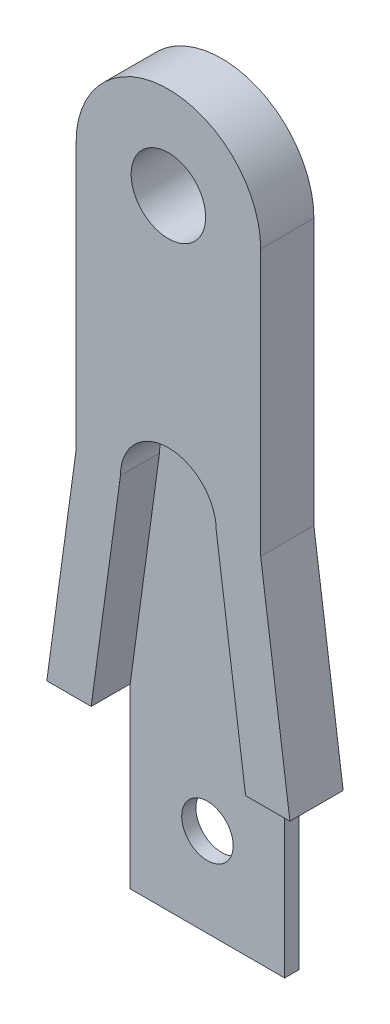
ISO-10303-21;
HEADER;
FILE_DESCRIPTION(('STEP AP214'),'2;1');
FILE_NAME('part.step','',(''),(''),'','','');
FILE_SCHEMA(('AUTOMOTIVE_DESIGN { 1 0 10303 214 1 1 1 1 }'));
ENDSEC;
DATA;
#1=APPLICATION_CONTEXT('core data for automotive mechanical design processes');
#2=APPLICATION_PROTOCOL_DEFINITION('international standard','automotive_design',2000,#1);
#3=PRODUCT_CONTEXT('',#1,'mechanical');
#4=PRODUCT('Part','Part','',(#3));
#5=PRODUCT_RELATED_PRODUCT_CATEGORY('part','',(#4));
#6=PRODUCT_DEFINITION_FORMATION('','',#4);
#7=PRODUCT_DEFINITION_CONTEXT('part definition',#1,'design');
#8=PRODUCT_DEFINITION('design','',#6,#7);
#9=PRODUCT_DEFINITION_SHAPE('','',#8);
#10=(LENGTH_UNIT() NAMED_UNIT(*) SI_UNIT(.MILLI.,.METRE.));
#11=(NAMED_UNIT(*) PLANE_ANGLE_UNIT() SI_UNIT($,.RADIAN.));
#12=(NAMED_UNIT(*) SI_UNIT($,.STERADIAN.) SOLID_ANGLE_UNIT());
#13=UNCERTAINTY_MEASURE_WITH_UNIT(LENGTH_MEASURE(1.E-05),#10,'distance_accuracy_value','');
#14=(GEOMETRIC_REPRESENTATION_CONTEXT(3) GLOBAL_UNCERTAINTY_ASSIGNED_CONTEXT((#13)) GLOBAL_UNIT_ASSIGNED_CONTEXT((#10,
#11,#12)) REPRESENTATION_CONTEXT('',''));
#15=CARTESIAN_POINT('',(0.,0.,0.));
#16=DIRECTION('',(0.,0.,1.));
#17=DIRECTION('',(1.,0.,0.));
#18=AXIS2_PLACEMENT_3D('',#15,#16,#17);
#19=CARTESIAN_POINT('',(3.59168404829559,4.41177816907904,7.05608106349905));
#20=DIRECTION('',(0.,-1.,0.));
#21=DIRECTION('',(1.,0.,0.));
#22=AXIS2_PLACEMENT_3D('',#19,#20,#21);
#23=PLANE('',#22);
#24=DIRECTION('',(0.,0.,1.));
#25=VECTOR('',#24,1.);
#26=CARTESIAN_POINT('',(1.09168404829559,4.41177816907904,4.85608106349905));
#27=LINE('',#26,#25);
#28=CARTESIAN_POINT('',(1.09168404829559,4.41177816907904,4.05608106349905));
#29=VERTEX_POINT('',#28);
#30=CARTESIAN_POINT('',(1.09168404829559,4.41177816907904,4.85608106349905));
#31=VERTEX_POINT('',#30);
#32=EDGE_CURVE('E63',#29,#31,#27,.T.);
#33=ORIENTED_EDGE('',*,*,#32,.F.);
#34=DIRECTION('',(-1.,0.,0.));
#35=VECTOR('',#34,1.);
#36=CARTESIAN_POINT('',(3.59168404829559,4.41177816907904,4.05608106349905));
#37=LINE('',#36,#35);
#38=CARTESIAN_POINT('',(3.59168404829559,4.41177816907904,4.05608106349905));
#39=VERTEX_POINT('',#38);
#40=EDGE_CURVE('E244',#39,#29,#37,.T.);
#41=ORIENTED_EDGE('',*,*,#40,.F.);
#42=DIRECTION('',(0.,0.,-1.));
#43=VECTOR('',#42,1.);
#44=CARTESIAN_POINT('',(3.59168404829559,4.41177816907904,7.05608106349905));
#45=LINE('',#44,#43);
#46=CARTESIAN_POINT('',(3.59168404829559,4.41177816907904,7.05608106349905));
#47=VERTEX_POINT('',#46);
#48=EDGE_CURVE('E266',#47,#39,#45,.T.);
#49=ORIENTED_EDGE('',*,*,#48,.F.);
#50=DIRECTION('',(-1.,0.,0.));
#51=VECTOR('',#50,1.);
#52=CARTESIAN_POINT('',(3.59168404829559,4.41177816907904,7.05608106349905));
#53=LINE('',#52,#51);
#54=CARTESIAN_POINT('',(1.09168404829559,4.41177816907904,7.05608106349905));
#55=VERTEX_POINT('',#54);
#56=EDGE_CURVE('E220',#47,#55,#53,.T.);
#57=ORIENTED_EDGE('',*,*,#56,.T.);
#58=DIRECTION('',(0.,0.,1.));
#59=VECTOR('',#58,1.);
#60=CARTESIAN_POINT('',(1.09168404829559,4.41177816907904,4.85608106349905));
#61=LINE('',#60,#59);
#62=EDGE_CURVE('E70',#31,#55,#61,.T.);
#63=ORIENTED_EDGE('',*,*,#62,.F.);
#64=EDGE_LOOP('',(#33,#41,#49,#57,#63));
#65=FACE_BOUND('',#64,.T.);
#66=ADVANCED_FACE('F45',(#65),#23,.T.);
#67=CARTESIAN_POINT('',(1.94168404829558,31.511778169079,7.05608106349905));
#68=DIRECTION('',(1.,0.,0.));
#69=DIRECTION('',(0.,1.,0.));
#70=AXIS2_PLACEMENT_3D('',#67,#68,#69);
#71=PLANE('',#70);
#72=DIRECTION('',(0.,-1.,0.));
#73=VECTOR('',#72,1.);
#74=CARTESIAN_POINT('',(1.94168404829558,31.511778169079,4.05608106349905));
#75=LINE('',#74,#73);
#76=CARTESIAN_POINT('',(1.94168404829558,31.511778169079,4.05608106349905));
#77=VERTEX_POINT('',#76);
#78=CARTESIAN_POINT('',(1.94168404829559,16.511778169079,4.05608106349905));
#79=VERTEX_POINT('',#78);
#80=EDGE_CURVE('E201',#77,#79,#75,.T.);
#81=ORIENTED_EDGE('',*,*,#80,.F.);
#82=DIRECTION('',(0.,0.,-1.));
#83=VECTOR('',#82,1.);
#84=CARTESIAN_POINT('',(1.94168404829558,31.511778169079,7.05608106349905));
#85=LINE('',#84,#83);
#86=CARTESIAN_POINT('',(1.94168404829558,31.511778169079,7.05608106349905));
#87=VERTEX_POINT('',#86);
#88=EDGE_CURVE('E11',#87,#77,#85,.T.);
#89=ORIENTED_EDGE('',*,*,#88,.F.);
#90=DIRECTION('',(0.,-1.,0.));
#91=VECTOR('',#90,1.);
#92=CARTESIAN_POINT('',(1.94168404829558,31.511778169079,7.05608106349905));
#93=LINE('',#92,#91);
#94=CARTESIAN_POINT('',(1.94168404829559,16.511778169079,7.05608106349905));
#95=VERTEX_POINT('',#94);
#96=EDGE_CURVE('E210',#87,#95,#93,.T.);
#97=ORIENTED_EDGE('',*,*,#96,.T.);
#98=DIRECTION('',(0.,0.,-1.));
#99=VECTOR('',#98,1.);
#100=CARTESIAN_POINT('',(1.94168404829559,16.511778169079,7.05608106349905));
#101=LINE('',#100,#99);
#102=EDGE_CURVE('E49',#95,#79,#101,.T.);
#103=ORIENTED_EDGE('',*,*,#102,.T.);
#104=EDGE_LOOP('',(#81,#89,#97,#103));
#105=FACE_BOUND('',#104,.T.);
#106=ADVANCED_FACE('F47',(#105),#71,.T.);
#107=CARTESIAN_POINT('',(-3.25831595170442,31.511778169079,7.05608106349905));
#108=DIRECTION('',(0.,0.,-1.));
#109=DIRECTION('',(-1.,0.,0.));
#110=AXIS2_PLACEMENT_3D('',#107,#108,#109);
#111=CYLINDRICAL_SURFACE('',#110,5.2);
#112=CARTESIAN_POINT('',(-3.25831595170442,31.511778169079,4.05608106349905));
#113=DIRECTION('',(0.,0.,-1.));
#114=DIRECTION('',(-1.,0.,0.));
#115=AXIS2_PLACEMENT_3D('',#112,#113,#114);
#116=CIRCLE('',#115,5.2);
#117=CARTESIAN_POINT('',(-8.45831595170442,31.511778169079,4.05608106349905));
#118=VERTEX_POINT('',#117);
#119=EDGE_CURVE('E215',#118,#77,#116,.T.);
#120=ORIENTED_EDGE('',*,*,#119,.F.);
#121=DIRECTION('',(0.,0.,-1.));
#122=VECTOR('',#121,1.);
#123=CARTESIAN_POINT('',(-8.45831595170442,31.511778169079,7.05608106349905));
#124=LINE('',#123,#122);
#125=CARTESIAN_POINT('',(-8.45831595170442,31.511778169079,7.05608106349905));
#126=VERTEX_POINT('',#125);
#127=EDGE_CURVE('E55',#126,#118,#124,.T.);
#128=ORIENTED_EDGE('',*,*,#127,.F.);
#129=CARTESIAN_POINT('',(-3.25831595170442,31.511778169079,7.05608106349905));
#130=DIRECTION('',(0.,0.,-1.));
#131=DIRECTION('',(-1.,0.,0.));
#132=AXIS2_PLACEMENT_3D('',#129,#130,#131);
#133=CIRCLE('',#132,5.2);
#134=EDGE_CURVE('E232',#126,#87,#133,.T.);
#135=ORIENTED_EDGE('',*,*,#134,.T.);
#136=ORIENTED_EDGE('',*,*,#88,.T.);
#137=EDGE_LOOP('',(#120,#128,#135,#136));
#138=FACE_BOUND('',#137,.T.);
#139=ADVANCED_FACE('F281',(#138),#111,.T.);
#140=CARTESIAN_POINT('',(-8.45831595170441,16.511778169079,7.05608106349905));
#141=DIRECTION('',(-1.,0.,0.));
#142=DIRECTION('',(0.,-1.,0.));
#143=AXIS2_PLACEMENT_3D('',#140,#141,#142);
#144=PLANE('',#143);
#145=DIRECTION('',(0.,1.,0.));
#146=VECTOR('',#145,1.);
#147=CARTESIAN_POINT('',(-8.45831595170441,16.511778169079,4.05608106349905));
#148=LINE('',#147,#146);
#149=CARTESIAN_POINT('',(-8.45831595170441,16.511778169079,4.05608106349905));
#150=VERTEX_POINT('',#149);
#151=EDGE_CURVE('E251',#150,#118,#148,.T.);
#152=ORIENTED_EDGE('',*,*,#151,.F.);
#153=DIRECTION('',(0.,0.,-1.));
#154=VECTOR('',#153,1.);
#155=CARTESIAN_POINT('',(-8.45831595170441,16.511778169079,7.05608106349905));
#156=LINE('',#155,#154);
#157=CARTESIAN_POINT('',(-8.45831595170441,16.511778169079,7.05608106349905));
#158=VERTEX_POINT('',#157);
#159=EDGE_CURVE('E260',#158,#150,#156,.T.);
#160=ORIENTED_EDGE('',*,*,#159,.F.);
#161=DIRECTION('',(0.,1.,0.));
#162=VECTOR('',#161,1.);
#163=CARTESIAN_POINT('',(-8.45831595170441,16.511778169079,7.05608106349905));
#164=LINE('',#163,#162);
#165=EDGE_CURVE('E228',#158,#126,#164,.T.);
#166=ORIENTED_EDGE('',*,*,#165,.T.);
#167=ORIENTED_EDGE('',*,*,#127,.T.);
#168=EDGE_LOOP('',(#152,#160,#166,#167));
#169=FACE_BOUND('',#168,.T.);
#170=ADVANCED_FACE('F359',(#169),#144,.T.);
#171=CARTESIAN_POINT('',(-10.1083159517044,4.41177816907904,7.05608106349905));
#172=DIRECTION('',(-0.990830168044299,0.135113204733313,0.));
#173=DIRECTION('',(-0.135113204733313,-0.990830168044299,0.));
#174=AXIS2_PLACEMENT_3D('',#171,#172,#173);
#175=PLANE('',#174);
#176=DIRECTION('',(0.135113204733313,0.990830168044299,0.));
#177=VECTOR('',#176,1.);
#178=CARTESIAN_POINT('',(-10.1083159517044,4.41177816907904,4.05608106349905));
#179=LINE('',#178,#177);
#180=CARTESIAN_POINT('',(-10.1083159517044,4.41177816907904,4.05608106349905));
#181=VERTEX_POINT('',#180);
#182=EDGE_CURVE('E247',#181,#150,#179,.T.);
#183=ORIENTED_EDGE('',*,*,#182,.F.);
#184=DIRECTION('',(0.,0.,-1.));
#185=VECTOR('',#184,1.);
#186=CARTESIAN_POINT('',(-10.1083159517044,4.41177816907904,7.05608106349905));
#187=LINE('',#186,#185);
#188=CARTESIAN_POINT('',(-10.1083159517044,4.41177816907904,7.05608106349905));
#189=VERTEX_POINT('',#188);
#190=EDGE_CURVE('E263',#189,#181,#187,.T.);
#191=ORIENTED_EDGE('',*,*,#190,.F.);
#192=DIRECTION('',(0.135113204733313,0.990830168044299,0.));
#193=VECTOR('',#192,1.);
#194=CARTESIAN_POINT('',(-10.1083159517044,4.41177816907904,7.05608106349905));
#195=LINE('',#194,#193);
#196=EDGE_CURVE('E224',#189,#158,#195,.T.);
#197=ORIENTED_EDGE('',*,*,#196,.T.);
#198=ORIENTED_EDGE('',*,*,#159,.T.);
#199=EDGE_LOOP('',(#183,#191,#197,#198));
#200=FACE_BOUND('',#199,.T.);
#201=ADVANCED_FACE('F352',(#200),#175,.T.);
#202=DIRECTION('',(0.,0.,-1.));
#203=VECTOR('',#202,1.);
#204=CARTESIAN_POINT('',(-7.60831595170441,4.41177816907904,4.05608106349905));
#205=LINE('',#204,#203);
#206=CARTESIAN_POINT('',(-7.60831595170441,4.41177816907903,4.85608106349905));
#207=VERTEX_POINT('',#206);
#208=CARTESIAN_POINT('',(-7.60831595170441,4.41177816907904,4.05608106349905));
#209=VERTEX_POINT('',#208);
#210=EDGE_CURVE('E167',#207,#209,#205,.T.);
#211=ORIENTED_EDGE('',*,*,#210,.F.);
#212=DIRECTION('',(0.,0.,1.));
#213=VECTOR('',#212,1.);
#214=CARTESIAN_POINT('',(-7.60831595170441,4.41177816907903,4.85608106349905));
#215=LINE('',#214,#213);
#216=CARTESIAN_POINT('',(-7.60831595170441,4.41177816907903,7.05608106349905));
#217=VERTEX_POINT('',#216);
#218=EDGE_CURVE('E197',#207,#217,#215,.T.);
#219=ORIENTED_EDGE('',*,*,#218,.T.);
#220=EDGE_CURVE('E219',#217,#189,#53,.T.);
#221=ORIENTED_EDGE('',*,*,#220,.T.);
#222=ORIENTED_EDGE('',*,*,#190,.T.);
#223=EDGE_CURVE('E243',#209,#181,#37,.T.);
#224=ORIENTED_EDGE('',*,*,#223,.F.);
#225=EDGE_LOOP('',(#211,#219,#221,#222,#224));
#226=FACE_BOUND('',#225,.T.);
#227=ADVANCED_FACE('F345',(#226),#23,.T.);
#228=CARTESIAN_POINT('',(1.94168404829559,16.511778169079,7.05608106349905));
#229=DIRECTION('',(0.990830168044299,0.135113204733314,0.));
#230=DIRECTION('',(-0.135113204733314,0.990830168044299,0.));
#231=AXIS2_PLACEMENT_3D('',#228,#229,#230);
#232=PLANE('',#231);
#233=DIRECTION('',(0.135113204733314,-0.990830168044299,0.));
#234=VECTOR('',#233,1.);
#235=CARTESIAN_POINT('',(1.94168404829559,16.511778169079,4.05608106349905));
#236=LINE('',#235,#234);
#237=EDGE_CURVE('E239',#79,#39,#236,.T.);
#238=ORIENTED_EDGE('',*,*,#237,.F.);
#239=ORIENTED_EDGE('',*,*,#102,.F.);
#240=DIRECTION('',(0.135113204733314,-0.990830168044299,0.));
#241=VECTOR('',#240,1.);
#242=CARTESIAN_POINT('',(1.94168404829559,16.511778169079,7.05608106349905));
#243=LINE('',#242,#241);
#244=EDGE_CURVE('E214',#95,#47,#243,.T.);
#245=ORIENTED_EDGE('',*,*,#244,.T.);
#246=ORIENTED_EDGE('',*,*,#48,.T.);
#247=EDGE_LOOP('',(#238,#239,#245,#246));
#248=FACE_BOUND('',#247,.T.);
#249=ADVANCED_FACE('F275',(#248),#232,.T.);
#250=CARTESIAN_POINT('',(-3.25831595170442,31.511778169079,7.05608106349905));
#251=DIRECTION('',(0.,0.,-1.));
#252=DIRECTION('',(-1.,0.,0.));
#253=AXIS2_PLACEMENT_3D('',#250,#251,#252);
#254=PLANE('',#253);
#255=CARTESIAN_POINT('',(-3.25831595170442,31.511778169079,7.05608106349905));
#256=DIRECTION('',(0.,0.,-1.));
#257=DIRECTION('',(-1.,0.,0.));
#258=AXIS2_PLACEMENT_3D('',#255,#256,#257);
#259=CIRCLE('',#258,2.1);
#260=CARTESIAN_POINT('',(-5.35831595170442,31.511778169079,7.05608106349905));
#261=VERTEX_POINT('',#260);
#262=EDGE_CURVE('E301',#261,#261,#259,.T.);
#263=ORIENTED_EDGE('',*,*,#262,.T.);
#264=EDGE_LOOP('',(#263));
#265=FACE_BOUND('',#264,.T.);
#266=ORIENTED_EDGE('',*,*,#220,.F.);
#267=DIRECTION('',(-0.135113204733313,-0.990830168044299,0.));
#268=VECTOR('',#267,1.);
#269=CARTESIAN_POINT('',(-5.95831595170441,16.511778169079,7.05608106349905));
#270=LINE('',#269,#268);
#271=CARTESIAN_POINT('',(-5.95831595170441,16.511778169079,7.05608106349905));
#272=VERTEX_POINT('',#271);
#273=EDGE_CURVE('E185',#272,#217,#270,.T.);
#274=ORIENTED_EDGE('',*,*,#273,.F.);
#275=CARTESIAN_POINT('',(-3.25831595170441,16.511778169079,7.05608106349905));
#276=DIRECTION('',(0.,0.,1.));
#277=DIRECTION('',(1.,0.,0.));
#278=AXIS2_PLACEMENT_3D('',#275,#276,#277);
#279=CIRCLE('',#278,2.7);
#280=CARTESIAN_POINT('',(-0.558315951704415,16.511778169079,7.05608106349905));
#281=VERTEX_POINT('',#280);
#282=EDGE_CURVE('E175',#281,#272,#279,.T.);
#283=ORIENTED_EDGE('',*,*,#282,.F.);
#284=DIRECTION('',(-0.135113204733314,0.990830168044299,0.));
#285=VECTOR('',#284,1.);
#286=CARTESIAN_POINT('',(1.09168404829559,4.41177816907904,7.05608106349905));
#287=LINE('',#286,#285);
#288=EDGE_CURVE('E171',#55,#281,#287,.T.);
#289=ORIENTED_EDGE('',*,*,#288,.F.);
#290=ORIENTED_EDGE('',*,*,#56,.F.);
#291=ORIENTED_EDGE('',*,*,#244,.F.);
#292=ORIENTED_EDGE('',*,*,#96,.F.);
#293=ORIENTED_EDGE('',*,*,#134,.F.);
#294=ORIENTED_EDGE('',*,*,#165,.F.);
#295=ORIENTED_EDGE('',*,*,#196,.F.);
#296=EDGE_LOOP('',(#266,#274,#283,#289,#290,#291,#292,#293,#294,#295));
#297=FACE_BOUND('',#296,.T.);
#298=ADVANCED_FACE('F285',(#265,#297),#254,.F.);
#299=CARTESIAN_POINT('',(-3.25831595170442,31.511778169079,4.05608106349905));
#300=DIRECTION('',(0.,0.,-1.));
#301=DIRECTION('',(-1.,0.,0.));
#302=AXIS2_PLACEMENT_3D('',#299,#300,#301);
#303=PLANE('',#302);
#304=CARTESIAN_POINT('',(-3.25831595170441,-0.588221830920964,4.05608106349905));
#305=DIRECTION('',(0.,0.,-1.));
#306=DIRECTION('',(-1.,0.,0.));
#307=AXIS2_PLACEMENT_3D('',#304,#305,#306);
#308=CIRCLE('',#307,1.44999999999999);
#309=CARTESIAN_POINT('',(-4.7083159517044,-0.588221830920964,4.05608106349905));
#310=VERTEX_POINT('',#309);
#311=EDGE_CURVE('E316',#310,#310,#308,.T.);
#312=ORIENTED_EDGE('',*,*,#311,.F.);
#313=EDGE_LOOP('',(#312));
#314=FACE_BOUND('',#313,.T.);
#315=CARTESIAN_POINT('',(-3.25831595170442,31.511778169079,4.05608106349905));
#316=DIRECTION('',(0.,0.,-1.));
#317=DIRECTION('',(-1.,0.,0.));
#318=AXIS2_PLACEMENT_3D('',#315,#316,#317);
#319=CIRCLE('',#318,2.1);
#320=CARTESIAN_POINT('',(-5.35831595170442,31.511778169079,4.05608106349905));
#321=VERTEX_POINT('',#320);
#322=EDGE_CURVE('E308',#321,#321,#319,.T.);
#323=ORIENTED_EDGE('',*,*,#322,.F.);
#324=EDGE_LOOP('',(#323));
#325=FACE_BOUND('',#324,.T.);
#326=ORIENTED_EDGE('',*,*,#80,.T.);
#327=ORIENTED_EDGE('',*,*,#237,.T.);
#328=ORIENTED_EDGE('',*,*,#40,.T.);
#329=DIRECTION('',(0.,1.,0.));
#330=VECTOR('',#329,1.);
#331=CARTESIAN_POINT('',(1.09168404829559,-5.58822183092096,4.05608106349905));
#332=LINE('',#331,#330);
#333=CARTESIAN_POINT('',(1.09168404829559,-5.58822183092096,4.05608106349905));
#334=VERTEX_POINT('',#333);
#335=EDGE_CURVE('E289',#334,#29,#332,.T.);
#336=ORIENTED_EDGE('',*,*,#335,.F.);
#337=DIRECTION('',(1.,0.,0.));
#338=VECTOR('',#337,1.);
#339=CARTESIAN_POINT('',(1.09168404829559,-5.58822183092096,4.05608106349905));
#340=LINE('',#339,#338);
#341=CARTESIAN_POINT('',(-7.60831595170441,-5.58822183092096,4.05608106349905));
#342=VERTEX_POINT('',#341);
#343=EDGE_CURVE('E162',#342,#334,#340,.T.);
#344=ORIENTED_EDGE('',*,*,#343,.F.);
#345=DIRECTION('',(0.,1.,0.));
#346=VECTOR('',#345,1.);
#347=CARTESIAN_POINT('',(-7.60831595170441,-5.58822183092096,4.05608106349905));
#348=LINE('',#347,#346);
#349=EDGE_CURVE('E177',#342,#209,#348,.T.);
#350=ORIENTED_EDGE('',*,*,#349,.T.);
#351=ORIENTED_EDGE('',*,*,#223,.T.);
#352=ORIENTED_EDGE('',*,*,#182,.T.);
#353=ORIENTED_EDGE('',*,*,#151,.T.);
#354=ORIENTED_EDGE('',*,*,#119,.T.);
#355=EDGE_LOOP('',(#326,#327,#328,#336,#344,#350,#351,#352,#353,#354));
#356=FACE_BOUND('',#355,.T.);
#357=ADVANCED_FACE('F277',(#314,#325,#356),#303,.T.);
#358=CARTESIAN_POINT('',(-5.95831595170441,16.511778169079,4.85608106349905));
#359=DIRECTION('',(-0.990830168044299,0.135113204733313,0.));
#360=DIRECTION('',(-0.135113204733313,-0.990830168044299,0.));
#361=AXIS2_PLACEMENT_3D('',#358,#359,#360);
#362=PLANE('',#361);
#363=ORIENTED_EDGE('',*,*,#273,.T.);
#364=ORIENTED_EDGE('',*,*,#218,.F.);
#365=DIRECTION('',(-0.135113204733313,-0.990830168044299,0.));
#366=VECTOR('',#365,1.);
#367=CARTESIAN_POINT('',(-5.95831595170441,16.511778169079,4.85608106349905));
#368=LINE('',#367,#366);
#369=CARTESIAN_POINT('',(-5.95831595170441,16.511778169079,4.85608106349905));
#370=VERTEX_POINT('',#369);
#371=EDGE_CURVE('E189',#370,#207,#368,.T.);
#372=ORIENTED_EDGE('',*,*,#371,.F.);
#373=DIRECTION('',(0.,0.,1.));
#374=VECTOR('',#373,1.);
#375=CARTESIAN_POINT('',(-5.95831595170441,16.511778169079,4.85608106349905));
#376=LINE('',#375,#374);
#377=EDGE_CURVE('E202',#370,#272,#376,.T.);
#378=ORIENTED_EDGE('',*,*,#377,.T.);
#379=EDGE_LOOP('',(#363,#364,#372,#378));
#380=FACE_BOUND('',#379,.T.);
#381=ADVANCED_FACE('F325',(#380),#362,.F.);
#382=CARTESIAN_POINT('',(-3.25831595170441,16.511778169079,4.85608106349905));
#383=DIRECTION('',(0.,0.,1.));
#384=DIRECTION('',(1.,0.,0.));
#385=AXIS2_PLACEMENT_3D('',#382,#383,#384);
#386=CYLINDRICAL_SURFACE('',#385,2.7);
#387=ORIENTED_EDGE('',*,*,#282,.T.);
#388=ORIENTED_EDGE('',*,*,#377,.F.);
#389=CARTESIAN_POINT('',(-3.25831595170441,16.511778169079,4.85608106349905));
#390=DIRECTION('',(0.,0.,1.));
#391=DIRECTION('',(1.,0.,0.));
#392=AXIS2_PLACEMENT_3D('',#389,#390,#391);
#393=CIRCLE('',#392,2.7);
#394=CARTESIAN_POINT('',(-0.558315951704415,16.511778169079,4.85608106349905));
#395=VERTEX_POINT('',#394);
#396=EDGE_CURVE('E184',#395,#370,#393,.T.);
#397=ORIENTED_EDGE('',*,*,#396,.F.);
#398=DIRECTION('',(0.,0.,1.));
#399=VECTOR('',#398,1.);
#400=CARTESIAN_POINT('',(-0.558315951704415,16.511778169079,4.85608106349905));
#401=LINE('',#400,#399);
#402=EDGE_CURVE('E205',#395,#281,#401,.T.);
#403=ORIENTED_EDGE('',*,*,#402,.T.);
#404=EDGE_LOOP('',(#387,#388,#397,#403));
#405=FACE_BOUND('',#404,.T.);
#406=ADVANCED_FACE('F375',(#405),#386,.F.);
#407=CARTESIAN_POINT('',(1.09168404829559,4.41177816907904,4.85608106349905));
#408=DIRECTION('',(0.990830168044299,0.135113204733314,0.));
#409=DIRECTION('',(-0.135113204733314,0.990830168044299,0.));
#410=AXIS2_PLACEMENT_3D('',#407,#408,#409);
#411=PLANE('',#410);
#412=ORIENTED_EDGE('',*,*,#288,.T.);
#413=ORIENTED_EDGE('',*,*,#402,.F.);
#414=DIRECTION('',(-0.135113204733314,0.990830168044299,0.));
#415=VECTOR('',#414,1.);
#416=CARTESIAN_POINT('',(1.09168404829559,4.41177816907904,4.85608106349905));
#417=LINE('',#416,#415);
#418=EDGE_CURVE('E181',#31,#395,#417,.T.);
#419=ORIENTED_EDGE('',*,*,#418,.F.);
#420=ORIENTED_EDGE('',*,*,#62,.T.);
#421=EDGE_LOOP('',(#412,#413,#419,#420));
#422=FACE_BOUND('',#421,.T.);
#423=ADVANCED_FACE('F376',(#422),#411,.F.);
#424=CARTESIAN_POINT('',(-3.25831595170441,16.511778169079,4.85608106349905));
#425=DIRECTION('',(0.,0.,1.));
#426=DIRECTION('',(1.,0.,0.));
#427=AXIS2_PLACEMENT_3D('',#424,#425,#426);
#428=PLANE('',#427);
#429=CARTESIAN_POINT('',(-3.25831595170441,-0.588221830920964,4.85608106349905));
#430=DIRECTION('',(0.,0.,1.));
#431=DIRECTION('',(1.,0.,0.));
#432=AXIS2_PLACEMENT_3D('',#429,#430,#431);
#433=CIRCLE('',#432,1.44999999999999);
#434=CARTESIAN_POINT('',(-1.80831595170442,-0.588221830920964,4.85608106349905));
#435=VERTEX_POINT('',#434);
#436=EDGE_CURVE('E312',#435,#435,#433,.T.);
#437=ORIENTED_EDGE('',*,*,#436,.F.);
#438=EDGE_LOOP('',(#437));
#439=FACE_BOUND('',#438,.T.);
#440=ORIENTED_EDGE('',*,*,#371,.T.);
#441=DIRECTION('',(0.,1.,0.));
#442=VECTOR('',#441,1.);
#443=CARTESIAN_POINT('',(-7.60831595170441,-5.58822183092096,4.85608106349905));
#444=LINE('',#443,#442);
#445=CARTESIAN_POINT('',(-7.60831595170441,-5.58822183092096,4.85608106349905));
#446=VERTEX_POINT('',#445);
#447=EDGE_CURVE('E152',#446,#207,#444,.T.);
#448=ORIENTED_EDGE('',*,*,#447,.F.);
#449=DIRECTION('',(-1.,0.,0.));
#450=VECTOR('',#449,1.);
#451=CARTESIAN_POINT('',(-7.60831595170441,-5.58822183092096,4.85608106349905));
#452=LINE('',#451,#450);
#453=CARTESIAN_POINT('',(1.09168404829559,-5.58822183092096,4.85608106349905));
#454=VERTEX_POINT('',#453);
#455=EDGE_CURVE('E144',#454,#446,#452,.T.);
#456=ORIENTED_EDGE('',*,*,#455,.F.);
#457=DIRECTION('',(0.,1.,0.));
#458=VECTOR('',#457,1.);
#459=CARTESIAN_POINT('',(1.09168404829559,-5.58822183092096,4.85608106349905));
#460=LINE('',#459,#458);
#461=EDGE_CURVE('E150',#454,#31,#460,.T.);
#462=ORIENTED_EDGE('',*,*,#461,.T.);
#463=ORIENTED_EDGE('',*,*,#418,.T.);
#464=ORIENTED_EDGE('',*,*,#396,.T.);
#465=EDGE_LOOP('',(#440,#448,#456,#462,#463,#464));
#466=FACE_BOUND('',#465,.T.);
#467=ADVANCED_FACE('F147',(#439,#466),#428,.T.);
#468=CARTESIAN_POINT('',(1.09168404829559,-5.58822183092096,4.85608106349905));
#469=DIRECTION('',(-1.,0.,0.));
#470=DIRECTION('',(0.,-1.,0.));
#471=AXIS2_PLACEMENT_3D('',#468,#469,#470);
#472=PLANE('',#471);
#473=ORIENTED_EDGE('',*,*,#32,.T.);
#474=ORIENTED_EDGE('',*,*,#461,.F.);
#475=DIRECTION('',(0.,0.,1.));
#476=VECTOR('',#475,1.);
#477=CARTESIAN_POINT('',(1.09168404829559,-5.58822183092096,4.85608106349905));
#478=LINE('',#477,#476);
#479=EDGE_CURVE('E157',#334,#454,#478,.T.);
#480=ORIENTED_EDGE('',*,*,#479,.F.);
#481=ORIENTED_EDGE('',*,*,#335,.T.);
#482=EDGE_LOOP('',(#473,#474,#480,#481));
#483=FACE_BOUND('',#482,.T.);
#484=ADVANCED_FACE('F169',(#483),#472,.F.);
#485=CARTESIAN_POINT('',(-7.60831595170441,-5.58822183092096,4.05608106349905));
#486=DIRECTION('',(1.,0.,0.));
#487=DIRECTION('',(0.,1.,0.));
#488=AXIS2_PLACEMENT_3D('',#485,#486,#487);
#489=PLANE('',#488);
#490=ORIENTED_EDGE('',*,*,#210,.T.);
#491=ORIENTED_EDGE('',*,*,#349,.F.);
#492=DIRECTION('',(0.,0.,-1.));
#493=VECTOR('',#492,1.);
#494=CARTESIAN_POINT('',(-7.60831595170441,-5.58822183092096,4.05608106349905));
#495=LINE('',#494,#493);
#496=EDGE_CURVE('E156',#446,#342,#495,.T.);
#497=ORIENTED_EDGE('',*,*,#496,.F.);
#498=ORIENTED_EDGE('',*,*,#447,.T.);
#499=EDGE_LOOP('',(#490,#491,#497,#498));
#500=FACE_BOUND('',#499,.T.);
#501=ADVANCED_FACE('F340',(#500),#489,.F.);
#502=CARTESIAN_POINT('',(0.,-5.58822183092096,0.));
#503=DIRECTION('',(0.,1.,0.));
#504=DIRECTION('',(-1.,0.,0.));
#505=AXIS2_PLACEMENT_3D('',#502,#503,#504);
#506=PLANE('',#505);
#507=ORIENTED_EDGE('',*,*,#479,.T.);
#508=ORIENTED_EDGE('',*,*,#455,.T.);
#509=ORIENTED_EDGE('',*,*,#496,.T.);
#510=ORIENTED_EDGE('',*,*,#343,.T.);
#511=EDGE_LOOP('',(#507,#508,#509,#510));
#512=FACE_BOUND('',#511,.T.);
#513=ADVANCED_FACE('F160',(#512),#506,.F.);
#514=CARTESIAN_POINT('',(-3.25831595170442,31.511778169079,4.05608106349905));
#515=DIRECTION('',(0.,0.,-1.));
#516=DIRECTION('',(-1.,0.,0.));
#517=AXIS2_PLACEMENT_3D('',#514,#515,#516);
#518=CYLINDRICAL_SURFACE('',#517,2.1);
#519=ORIENTED_EDGE('',*,*,#262,.F.);
#520=EDGE_LOOP('',(#519));
#521=FACE_BOUND('',#520,.T.);
#522=ORIENTED_EDGE('',*,*,#322,.T.);
#523=EDGE_LOOP('',(#522));
#524=FACE_BOUND('',#523,.T.);
#525=ADVANCED_FACE('F329',(#521,#524),#518,.F.);
#526=CARTESIAN_POINT('',(-3.25831595170441,-0.588221830920964,4.05608106349905));
#527=DIRECTION('',(0.,0.,-1.));
#528=DIRECTION('',(-1.,0.,0.));
#529=AXIS2_PLACEMENT_3D('',#526,#527,#528);
#530=CYLINDRICAL_SURFACE('',#529,1.44999999999999);
#531=ORIENTED_EDGE('',*,*,#436,.T.);
#532=EDGE_LOOP('',(#531));
#533=FACE_BOUND('',#532,.T.);
#534=ORIENTED_EDGE('',*,*,#311,.T.);
#535=EDGE_LOOP('',(#534));
#536=FACE_BOUND('',#535,.T.);
#537=ADVANCED_FACE('F321',(#533,#536),#530,.F.);
#538=CLOSED_SHELL('',(#66,#106,#139,#170,#201,#227,#249,#298,#357,#381,#406,#423,#467,#484,#501,
#513,#525,#537));
#539=MANIFOLD_SOLID_BREP('B2',#538);
#540=ADVANCED_BREP_SHAPE_REPRESENTATION('',(#18,#539),#14);
#541=SHAPE_DEFINITION_REPRESENTATION(#9,#540);
ENDSEC;
END-ISO-10303-21;
